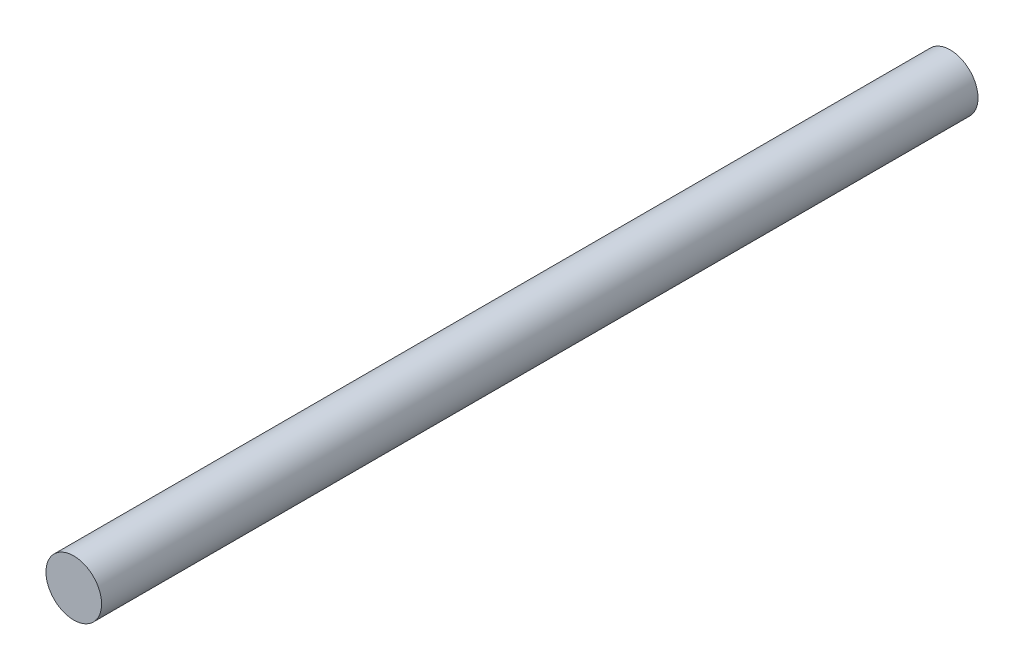
ISO-10303-21;
HEADER;
FILE_DESCRIPTION(('STEP AP214'),'2;1');
FILE_NAME('part.step','',(''),(''),'','','');
FILE_SCHEMA(('AUTOMOTIVE_DESIGN { 1 0 10303 214 1 1 1 1 }'));
ENDSEC;
DATA;
#1=APPLICATION_CONTEXT('core data for automotive mechanical design processes');
#2=APPLICATION_PROTOCOL_DEFINITION('international standard','automotive_design',2000,#1);
#3=PRODUCT_CONTEXT('',#1,'mechanical');
#4=PRODUCT('Part','Part','',(#3));
#5=PRODUCT_RELATED_PRODUCT_CATEGORY('part','',(#4));
#6=PRODUCT_DEFINITION_FORMATION('','',#4);
#7=PRODUCT_DEFINITION_CONTEXT('part definition',#1,'design');
#8=PRODUCT_DEFINITION('design','',#6,#7);
#9=PRODUCT_DEFINITION_SHAPE('','',#8);
#10=(LENGTH_UNIT() NAMED_UNIT(*) SI_UNIT(.MILLI.,.METRE.));
#11=(NAMED_UNIT(*) PLANE_ANGLE_UNIT() SI_UNIT($,.RADIAN.));
#12=(NAMED_UNIT(*) SI_UNIT($,.STERADIAN.) SOLID_ANGLE_UNIT());
#13=UNCERTAINTY_MEASURE_WITH_UNIT(LENGTH_MEASURE(1.E-05),#10,'distance_accuracy_value','');
#14=(GEOMETRIC_REPRESENTATION_CONTEXT(3) GLOBAL_UNCERTAINTY_ASSIGNED_CONTEXT((#13)) GLOBAL_UNIT_ASSIGNED_CONTEXT((#10,
#11,#12)) REPRESENTATION_CONTEXT('',''));
#15=CARTESIAN_POINT('',(0.,0.,0.));
#16=DIRECTION('',(0.,0.,1.));
#17=DIRECTION('',(1.,0.,0.));
#18=AXIS2_PLACEMENT_3D('',#15,#16,#17);
#19=CARTESIAN_POINT('',(0.,0.,52.));
#20=DIRECTION('',(0.,0.,-1.));
#21=DIRECTION('',(-1.,0.,0.));
#22=AXIS2_PLACEMENT_3D('',#19,#20,#21);
#23=CYLINDRICAL_SURFACE('',#22,1.65);
#24=CARTESIAN_POINT('',(0.,0.,52.));
#25=DIRECTION('',(0.,0.,1.));
#26=DIRECTION('',(1.,0.,0.));
#27=AXIS2_PLACEMENT_3D('',#24,#25,#26);
#28=CIRCLE('',#27,1.65);
#29=CARTESIAN_POINT('',(1.65,0.,52.));
#30=VERTEX_POINT('',#29);
#31=EDGE_CURVE('E10',#30,#30,#28,.T.);
#32=ORIENTED_EDGE('',*,*,#31,.F.);
#33=EDGE_LOOP('',(#32));
#34=FACE_BOUND('',#33,.T.);
#35=CARTESIAN_POINT('',(0.,0.,0.));
#36=DIRECTION('',(0.,0.,1.));
#37=DIRECTION('',(1.,0.,0.));
#38=AXIS2_PLACEMENT_3D('',#35,#36,#37);
#39=CIRCLE('',#38,1.65);
#40=CARTESIAN_POINT('',(1.65,0.,0.));
#41=VERTEX_POINT('',#40);
#42=EDGE_CURVE('E34',#41,#41,#39,.T.);
#43=ORIENTED_EDGE('',*,*,#42,.T.);
#44=EDGE_LOOP('',(#43));
#45=FACE_BOUND('',#44,.T.);
#46=ADVANCED_FACE('F31',(#34,#45),#23,.T.);
#47=CARTESIAN_POINT('',(0.,0.,52.));
#48=DIRECTION('',(0.,0.,1.));
#49=DIRECTION('',(1.,0.,0.));
#50=AXIS2_PLACEMENT_3D('',#47,#48,#49);
#51=PLANE('',#50);
#52=ORIENTED_EDGE('',*,*,#31,.T.);
#53=EDGE_LOOP('',(#52));
#54=FACE_BOUND('',#53,.T.);
#55=ADVANCED_FACE('F46',(#54),#51,.T.);
#56=CARTESIAN_POINT('',(0.,0.,0.));
#57=DIRECTION('',(0.,0.,1.));
#58=DIRECTION('',(1.,0.,0.));
#59=AXIS2_PLACEMENT_3D('',#56,#57,#58);
#60=PLANE('',#59);
#61=ORIENTED_EDGE('',*,*,#42,.F.);
#62=EDGE_LOOP('',(#61));
#63=FACE_BOUND('',#62,.T.);
#64=ADVANCED_FACE('F44',(#63),#60,.F.);
#65=CLOSED_SHELL('',(#46,#55,#64));
#66=MANIFOLD_SOLID_BREP('B2',#65);
#67=ADVANCED_BREP_SHAPE_REPRESENTATION('',(#18,#66),#14);
#68=SHAPE_DEFINITION_REPRESENTATION(#9,#67);
ENDSEC;
END-ISO-10303-21;
